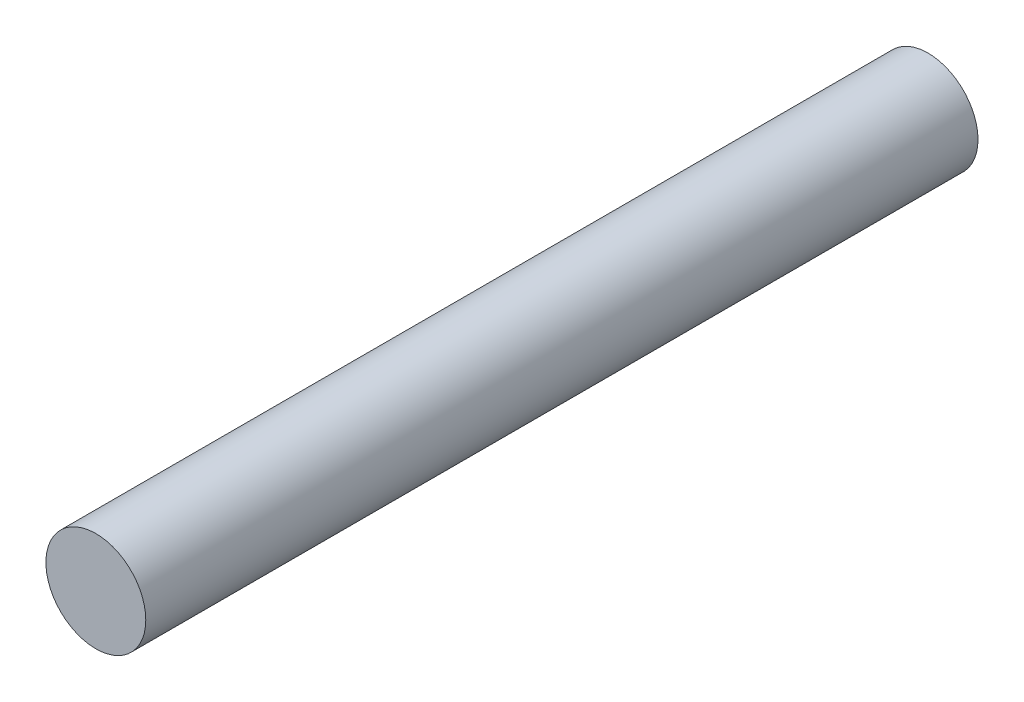
ISO-10303-21;
HEADER;
FILE_DESCRIPTION(('STEP AP214'),'2;1');
FILE_NAME('part.step','',(''),(''),'','','');
FILE_SCHEMA(('AUTOMOTIVE_DESIGN { 1 0 10303 214 1 1 1 1 }'));
ENDSEC;
DATA;
#1=APPLICATION_CONTEXT('core data for automotive mechanical design processes');
#2=APPLICATION_PROTOCOL_DEFINITION('international standard','automotive_design',2000,#1);
#3=PRODUCT_CONTEXT('',#1,'mechanical');
#4=PRODUCT('Part','Part','',(#3));
#5=PRODUCT_RELATED_PRODUCT_CATEGORY('part','',(#4));
#6=PRODUCT_DEFINITION_FORMATION('','',#4);
#7=PRODUCT_DEFINITION_CONTEXT('part definition',#1,'design');
#8=PRODUCT_DEFINITION('design','',#6,#7);
#9=PRODUCT_DEFINITION_SHAPE('','',#8);
#10=(LENGTH_UNIT() NAMED_UNIT(*) SI_UNIT(.MILLI.,.METRE.));
#11=(NAMED_UNIT(*) PLANE_ANGLE_UNIT() SI_UNIT($,.RADIAN.));
#12=(NAMED_UNIT(*) SI_UNIT($,.STERADIAN.) SOLID_ANGLE_UNIT());
#13=UNCERTAINTY_MEASURE_WITH_UNIT(LENGTH_MEASURE(1.E-05),#10,'distance_accuracy_value','');
#14=(GEOMETRIC_REPRESENTATION_CONTEXT(3) GLOBAL_UNCERTAINTY_ASSIGNED_CONTEXT((#13)) GLOBAL_UNIT_ASSIGNED_CONTEXT((#10,
#11,#12)) REPRESENTATION_CONTEXT('',''));
#15=CARTESIAN_POINT('',(0.,0.,0.));
#16=DIRECTION('',(0.,0.,1.));
#17=DIRECTION('',(1.,0.,0.));
#18=AXIS2_PLACEMENT_3D('',#15,#16,#17);
#19=CARTESIAN_POINT('',(0.,0.,50.));
#20=DIRECTION('',(0.,0.,-1.));
#21=DIRECTION('',(-1.,0.,0.));
#22=AXIS2_PLACEMENT_3D('',#19,#20,#21);
#23=CYLINDRICAL_SURFACE('',#22,3.);
#24=CARTESIAN_POINT('',(0.,0.,50.));
#25=DIRECTION('',(0.,0.,1.));
#26=DIRECTION('',(1.,0.,0.));
#27=AXIS2_PLACEMENT_3D('',#24,#25,#26);
#28=CIRCLE('',#27,3.);
#29=CARTESIAN_POINT('',(3.,0.,50.));
#30=VERTEX_POINT('',#29);
#31=EDGE_CURVE('E10',#30,#30,#28,.T.);
#32=ORIENTED_EDGE('',*,*,#31,.F.);
#33=EDGE_LOOP('',(#32));
#34=FACE_BOUND('',#33,.T.);
#35=CARTESIAN_POINT('',(0.,0.,0.));
#36=DIRECTION('',(0.,0.,1.));
#37=DIRECTION('',(1.,0.,0.));
#38=AXIS2_PLACEMENT_3D('',#35,#36,#37);
#39=CIRCLE('',#38,3.);
#40=CARTESIAN_POINT('',(3.,0.,0.));
#41=VERTEX_POINT('',#40);
#42=EDGE_CURVE('E38',#41,#41,#39,.T.);
#43=ORIENTED_EDGE('',*,*,#42,.T.);
#44=EDGE_LOOP('',(#43));
#45=FACE_BOUND('',#44,.T.);
#46=ADVANCED_FACE('F35',(#34,#45),#23,.T.);
#47=CARTESIAN_POINT('',(0.,0.,50.));
#48=DIRECTION('',(0.,0.,1.));
#49=DIRECTION('',(1.,0.,0.));
#50=AXIS2_PLACEMENT_3D('',#47,#48,#49);
#51=PLANE('',#50);
#52=ORIENTED_EDGE('',*,*,#31,.T.);
#53=EDGE_LOOP('',(#52));
#54=FACE_BOUND('',#53,.T.);
#55=ADVANCED_FACE('F50',(#54),#51,.T.);
#56=CARTESIAN_POINT('',(0.,0.,0.));
#57=DIRECTION('',(0.,0.,1.));
#58=DIRECTION('',(1.,0.,0.));
#59=AXIS2_PLACEMENT_3D('',#56,#57,#58);
#60=PLANE('',#59);
#61=ORIENTED_EDGE('',*,*,#42,.F.);
#62=EDGE_LOOP('',(#61));
#63=FACE_BOUND('',#62,.T.);
#64=ADVANCED_FACE('F48',(#63),#60,.F.);
#65=CLOSED_SHELL('',(#46,#55,#64));
#66=MANIFOLD_SOLID_BREP('B2',#65);
#67=ADVANCED_BREP_SHAPE_REPRESENTATION('',(#18,#66),#14);
#68=SHAPE_DEFINITION_REPRESENTATION(#9,#67);
ENDSEC;
END-ISO-10303-21;
